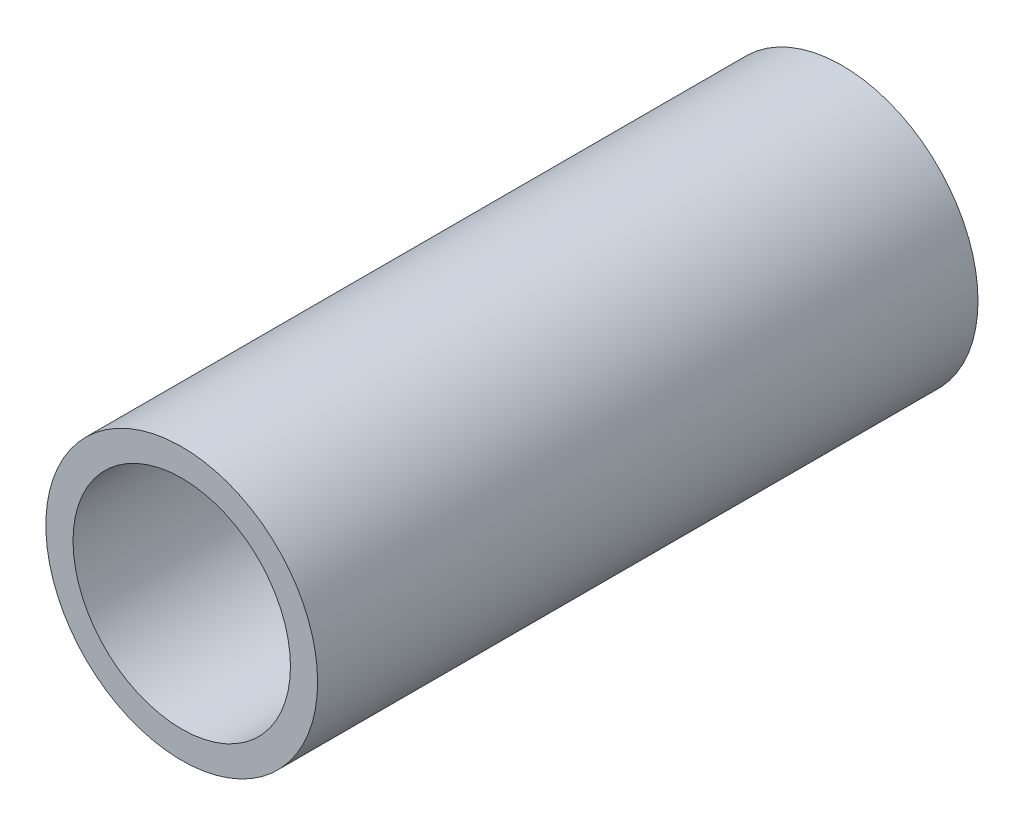
ISO-10303-21;
HEADER;
FILE_DESCRIPTION(('STEP AP214'),'2;1');
FILE_NAME('part.step','',(''),(''),'','','');
FILE_SCHEMA(('AUTOMOTIVE_DESIGN { 1 0 10303 214 1 1 1 1 }'));
ENDSEC;
DATA;
#1=APPLICATION_CONTEXT('core data for automotive mechanical design processes');
#2=APPLICATION_PROTOCOL_DEFINITION('international standard','automotive_design',2000,#1);
#3=PRODUCT_CONTEXT('',#1,'mechanical');
#4=PRODUCT('Part','Part','',(#3));
#5=PRODUCT_RELATED_PRODUCT_CATEGORY('part','',(#4));
#6=PRODUCT_DEFINITION_FORMATION('','',#4);
#7=PRODUCT_DEFINITION_CONTEXT('part definition',#1,'design');
#8=PRODUCT_DEFINITION('design','',#6,#7);
#9=PRODUCT_DEFINITION_SHAPE('','',#8);
#10=(LENGTH_UNIT() NAMED_UNIT(*) SI_UNIT(.MILLI.,.METRE.));
#11=(NAMED_UNIT(*) PLANE_ANGLE_UNIT() SI_UNIT($,.RADIAN.));
#12=(NAMED_UNIT(*) SI_UNIT($,.STERADIAN.) SOLID_ANGLE_UNIT());
#13=UNCERTAINTY_MEASURE_WITH_UNIT(LENGTH_MEASURE(1.E-05),#10,'distance_accuracy_value','');
#14=(GEOMETRIC_REPRESENTATION_CONTEXT(3) GLOBAL_UNCERTAINTY_ASSIGNED_CONTEXT((#13)) GLOBAL_UNIT_ASSIGNED_CONTEXT((#10,
#11,#12)) REPRESENTATION_CONTEXT('',''));
#15=CARTESIAN_POINT('',(0.,0.,0.));
#16=DIRECTION('',(0.,0.,1.));
#17=DIRECTION('',(1.,0.,0.));
#18=AXIS2_PLACEMENT_3D('',#15,#16,#17);
#19=CARTESIAN_POINT('',(0.,0.,12.15));
#20=DIRECTION('',(0.,0.,1.));
#21=DIRECTION('',(1.,0.,0.));
#22=AXIS2_PLACEMENT_3D('',#19,#20,#21);
#23=PLANE('',#22);
#24=CARTESIAN_POINT('',(0.,0.,12.15));
#25=DIRECTION('',(0.,0.,1.));
#26=DIRECTION('',(1.,0.,0.));
#27=AXIS2_PLACEMENT_3D('',#24,#25,#26);
#28=CIRCLE('',#27,2.5);
#29=CARTESIAN_POINT('',(2.5,0.,12.15));
#30=VERTEX_POINT('',#29);
#31=EDGE_CURVE('E10',#30,#30,#28,.T.);
#32=ORIENTED_EDGE('',*,*,#31,.T.);
#33=EDGE_LOOP('',(#32));
#34=FACE_BOUND('',#33,.T.);
#35=CARTESIAN_POINT('',(0.,0.,12.15));
#36=DIRECTION('',(0.,0.,1.));
#37=DIRECTION('',(1.,0.,0.));
#38=AXIS2_PLACEMENT_3D('',#35,#36,#37);
#39=CIRCLE('',#38,2.);
#40=CARTESIAN_POINT('',(2.,0.,12.15));
#41=VERTEX_POINT('',#40);
#42=EDGE_CURVE('E50',#41,#41,#39,.T.);
#43=ORIENTED_EDGE('',*,*,#42,.F.);
#44=EDGE_LOOP('',(#43));
#45=FACE_BOUND('',#44,.T.);
#46=ADVANCED_FACE('F37',(#34,#45),#23,.T.);
#47=CARTESIAN_POINT('',(0.,0.,0.));
#48=DIRECTION('',(0.,0.,1.));
#49=DIRECTION('',(1.,0.,0.));
#50=AXIS2_PLACEMENT_3D('',#47,#48,#49);
#51=PLANE('',#50);
#52=CARTESIAN_POINT('',(0.,0.,0.));
#53=DIRECTION('',(0.,0.,1.));
#54=DIRECTION('',(1.,0.,0.));
#55=AXIS2_PLACEMENT_3D('',#52,#53,#54);
#56=CIRCLE('',#55,2.5);
#57=CARTESIAN_POINT('',(2.5,0.,0.));
#58=VERTEX_POINT('',#57);
#59=EDGE_CURVE('E41',#58,#58,#56,.T.);
#60=ORIENTED_EDGE('',*,*,#59,.F.);
#61=EDGE_LOOP('',(#60));
#62=FACE_BOUND('',#61,.T.);
#63=CARTESIAN_POINT('',(0.,0.,0.));
#64=DIRECTION('',(0.,0.,1.));
#65=DIRECTION('',(1.,0.,0.));
#66=AXIS2_PLACEMENT_3D('',#63,#64,#65);
#67=CIRCLE('',#66,2.);
#68=CARTESIAN_POINT('',(2.,0.,0.));
#69=VERTEX_POINT('',#68);
#70=EDGE_CURVE('E52',#69,#69,#67,.T.);
#71=ORIENTED_EDGE('',*,*,#70,.T.);
#72=EDGE_LOOP('',(#71));
#73=FACE_BOUND('',#72,.T.);
#74=ADVANCED_FACE('F64',(#62,#73),#51,.F.);
#75=CARTESIAN_POINT('',(0.,0.,12.15));
#76=DIRECTION('',(0.,0.,-1.));
#77=DIRECTION('',(-1.,0.,0.));
#78=AXIS2_PLACEMENT_3D('',#75,#76,#77);
#79=CYLINDRICAL_SURFACE('',#78,2.5);
#80=ORIENTED_EDGE('',*,*,#31,.F.);
#81=EDGE_LOOP('',(#80));
#82=FACE_BOUND('',#81,.T.);
#83=ORIENTED_EDGE('',*,*,#59,.T.);
#84=EDGE_LOOP('',(#83));
#85=FACE_BOUND('',#84,.T.);
#86=ADVANCED_FACE('F39',(#82,#85),#79,.T.);
#87=CARTESIAN_POINT('',(0.,0.,12.15));
#88=DIRECTION('',(0.,0.,-1.));
#89=DIRECTION('',(-1.,0.,0.));
#90=AXIS2_PLACEMENT_3D('',#87,#88,#89);
#91=CYLINDRICAL_SURFACE('',#90,2.);
#92=ORIENTED_EDGE('',*,*,#42,.T.);
#93=EDGE_LOOP('',(#92));
#94=FACE_BOUND('',#93,.T.);
#95=ORIENTED_EDGE('',*,*,#70,.F.);
#96=EDGE_LOOP('',(#95));
#97=FACE_BOUND('',#96,.T.);
#98=ADVANCED_FACE('F60',(#94,#97),#91,.F.);
#99=CLOSED_SHELL('',(#46,#74,#86,#98));
#100=MANIFOLD_SOLID_BREP('B2',#99);
#101=ADVANCED_BREP_SHAPE_REPRESENTATION('',(#18,#100),#14);
#102=SHAPE_DEFINITION_REPRESENTATION(#9,#101);
ENDSEC;
END-ISO-10303-21;
